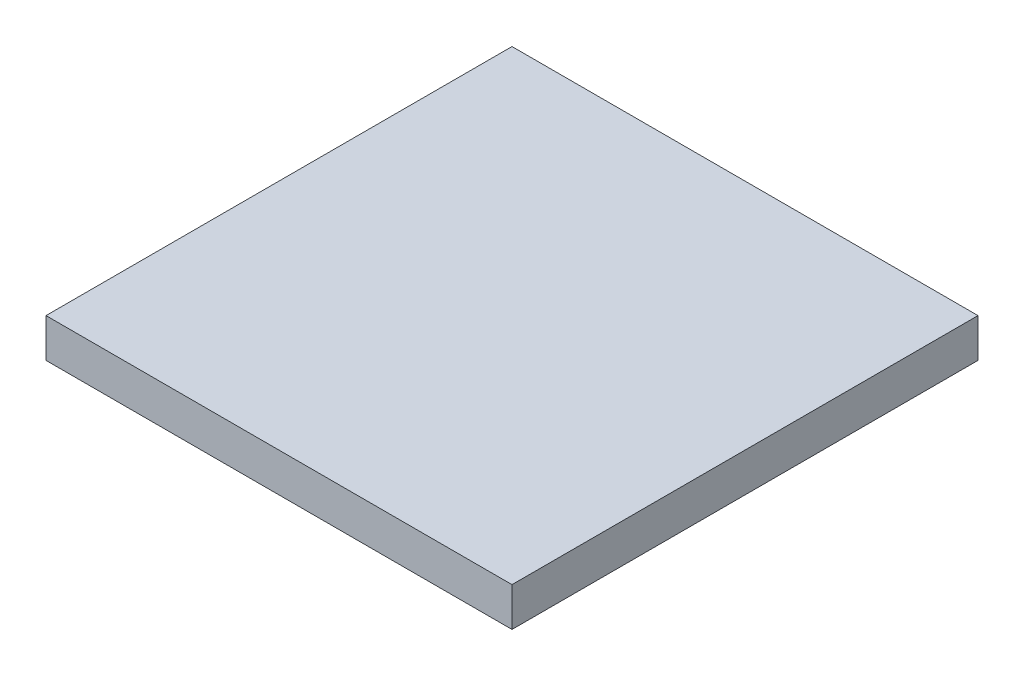
ISO-10303-21;
HEADER;
FILE_DESCRIPTION(('STEP AP214'),'2;1');
FILE_NAME('part.step','',(''),(''),'','','');
FILE_SCHEMA(('AUTOMOTIVE_DESIGN { 1 0 10303 214 1 1 1 1 }'));
ENDSEC;
DATA;
#1=APPLICATION_CONTEXT('core data for automotive mechanical design processes');
#2=APPLICATION_PROTOCOL_DEFINITION('international standard','automotive_design',2000,#1);
#3=PRODUCT_CONTEXT('',#1,'mechanical');
#4=PRODUCT('Part','Part','',(#3));
#5=PRODUCT_RELATED_PRODUCT_CATEGORY('part','',(#4));
#6=PRODUCT_DEFINITION_FORMATION('','',#4);
#7=PRODUCT_DEFINITION_CONTEXT('part definition',#1,'design');
#8=PRODUCT_DEFINITION('design','',#6,#7);
#9=PRODUCT_DEFINITION_SHAPE('','',#8);
#10=(LENGTH_UNIT() NAMED_UNIT(*) SI_UNIT(.MILLI.,.METRE.));
#11=(NAMED_UNIT(*) PLANE_ANGLE_UNIT() SI_UNIT($,.RADIAN.));
#12=(NAMED_UNIT(*) SI_UNIT($,.STERADIAN.) SOLID_ANGLE_UNIT());
#13=UNCERTAINTY_MEASURE_WITH_UNIT(LENGTH_MEASURE(1.E-05),#10,'distance_accuracy_value','');
#14=(GEOMETRIC_REPRESENTATION_CONTEXT(3) GLOBAL_UNCERTAINTY_ASSIGNED_CONTEXT((#13)) GLOBAL_UNIT_ASSIGNED_CONTEXT((#10,
#11,#12)) REPRESENTATION_CONTEXT('',''));
#15=CARTESIAN_POINT('',(0.,0.,0.));
#16=DIRECTION('',(0.,0.,1.));
#17=DIRECTION('',(1.,0.,0.));
#18=AXIS2_PLACEMENT_3D('',#15,#16,#17);
#19=CARTESIAN_POINT('',(0.,0.,0.));
#20=DIRECTION('',(0.,1.,0.));
#21=DIRECTION('',(0.,0.,1.));
#22=AXIS2_PLACEMENT_3D('',#19,#20,#21);
#23=PLANE('',#22);
#24=DIRECTION('',(0.,0.,-1.));
#25=VECTOR('',#24,1.);
#26=CARTESIAN_POINT('',(6.,0.,6.));
#27=LINE('',#26,#25);
#28=CARTESIAN_POINT('',(6.,0.,6.));
#29=VERTEX_POINT('',#28);
#30=CARTESIAN_POINT('',(6.,0.,-6.));
#31=VERTEX_POINT('',#30);
#32=EDGE_CURVE('E57',#29,#31,#27,.T.);
#33=ORIENTED_EDGE('',*,*,#32,.F.);
#34=DIRECTION('',(1.,0.,0.));
#35=VECTOR('',#34,1.);
#36=CARTESIAN_POINT('',(-6.,0.,6.));
#37=LINE('',#36,#35);
#38=CARTESIAN_POINT('',(-6.,0.,6.));
#39=VERTEX_POINT('',#38);
#40=EDGE_CURVE('E20',#39,#29,#37,.T.);
#41=ORIENTED_EDGE('',*,*,#40,.F.);
#42=DIRECTION('',(0.,0.,1.));
#43=VECTOR('',#42,1.);
#44=CARTESIAN_POINT('',(-6.,0.,-6.));
#45=LINE('',#44,#43);
#46=CARTESIAN_POINT('',(-6.,0.,-6.));
#47=VERTEX_POINT('',#46);
#48=EDGE_CURVE('E79',#47,#39,#45,.T.);
#49=ORIENTED_EDGE('',*,*,#48,.F.);
#50=DIRECTION('',(-1.,0.,0.));
#51=VECTOR('',#50,1.);
#52=CARTESIAN_POINT('',(6.,0.,-6.));
#53=LINE('',#52,#51);
#54=EDGE_CURVE('E55',#31,#47,#53,.T.);
#55=ORIENTED_EDGE('',*,*,#54,.F.);
#56=EDGE_LOOP('',(#33,#41,#49,#55));
#57=FACE_BOUND('',#56,.T.);
#58=ADVANCED_FACE('F17',(#57),#23,.F.);
#59=CARTESIAN_POINT('',(-6.,0.,6.));
#60=DIRECTION('',(0.,0.,1.));
#61=DIRECTION('',(1.,0.,0.));
#62=AXIS2_PLACEMENT_3D('',#59,#60,#61);
#63=PLANE('',#62);
#64=DIRECTION('',(1.,0.,0.));
#65=VECTOR('',#64,1.);
#66=CARTESIAN_POINT('',(0.,1.,6.));
#67=LINE('',#66,#65);
#68=CARTESIAN_POINT('',(-6.,1.,6.));
#69=VERTEX_POINT('',#68);
#70=CARTESIAN_POINT('',(6.,1.,6.));
#71=VERTEX_POINT('',#70);
#72=EDGE_CURVE('E83',#69,#71,#67,.T.);
#73=ORIENTED_EDGE('',*,*,#72,.F.);
#74=DIRECTION('',(0.,1.,0.));
#75=VECTOR('',#74,1.);
#76=CARTESIAN_POINT('',(-6.,0.,6.));
#77=LINE('',#76,#75);
#78=EDGE_CURVE('E68',#39,#69,#77,.T.);
#79=ORIENTED_EDGE('',*,*,#78,.F.);
#80=ORIENTED_EDGE('',*,*,#40,.T.);
#81=DIRECTION('',(0.,1.,0.));
#82=VECTOR('',#81,1.);
#83=CARTESIAN_POINT('',(6.,0.,6.));
#84=LINE('',#83,#82);
#85=EDGE_CURVE('E63',#71,#29,#84,.F.);
#86=ORIENTED_EDGE('',*,*,#85,.F.);
#87=EDGE_LOOP('',(#73,#79,#80,#86));
#88=FACE_BOUND('',#87,.T.);
#89=ADVANCED_FACE('F65',(#88),#63,.T.);
#90=CARTESIAN_POINT('',(6.,0.,6.));
#91=DIRECTION('',(1.,0.,0.));
#92=DIRECTION('',(0.,0.,-1.));
#93=AXIS2_PLACEMENT_3D('',#90,#91,#92);
#94=PLANE('',#93);
#95=DIRECTION('',(0.,0.,1.));
#96=VECTOR('',#95,1.);
#97=CARTESIAN_POINT('',(6.,1.,0.));
#98=LINE('',#97,#96);
#99=CARTESIAN_POINT('',(6.,1.,-6.));
#100=VERTEX_POINT('',#99);
#101=EDGE_CURVE('E72',#71,#100,#98,.F.);
#102=ORIENTED_EDGE('',*,*,#101,.F.);
#103=ORIENTED_EDGE('',*,*,#85,.T.);
#104=ORIENTED_EDGE('',*,*,#32,.T.);
#105=DIRECTION('',(0.,1.,0.));
#106=VECTOR('',#105,1.);
#107=CARTESIAN_POINT('',(6.,0.,-6.));
#108=LINE('',#107,#106);
#109=EDGE_CURVE('E75',#100,#31,#108,.F.);
#110=ORIENTED_EDGE('',*,*,#109,.F.);
#111=EDGE_LOOP('',(#102,#103,#104,#110));
#112=FACE_BOUND('',#111,.T.);
#113=ADVANCED_FACE('F70',(#112),#94,.T.);
#114=CARTESIAN_POINT('',(6.,0.,-6.));
#115=DIRECTION('',(0.,0.,-1.));
#116=DIRECTION('',(-1.,0.,0.));
#117=AXIS2_PLACEMENT_3D('',#114,#115,#116);
#118=PLANE('',#117);
#119=DIRECTION('',(1.,0.,0.));
#120=VECTOR('',#119,1.);
#121=CARTESIAN_POINT('',(0.,1.,-6.));
#122=LINE('',#121,#120);
#123=CARTESIAN_POINT('',(-6.,1.,-6.));
#124=VERTEX_POINT('',#123);
#125=EDGE_CURVE('E26',#100,#124,#122,.F.);
#126=ORIENTED_EDGE('',*,*,#125,.F.);
#127=ORIENTED_EDGE('',*,*,#109,.T.);
#128=ORIENTED_EDGE('',*,*,#54,.T.);
#129=DIRECTION('',(0.,1.,0.));
#130=VECTOR('',#129,1.);
#131=CARTESIAN_POINT('',(-6.,0.,-6.));
#132=LINE('',#131,#130);
#133=EDGE_CURVE('E35',#124,#47,#132,.F.);
#134=ORIENTED_EDGE('',*,*,#133,.F.);
#135=EDGE_LOOP('',(#126,#127,#128,#134));
#136=FACE_BOUND('',#135,.T.);
#137=ADVANCED_FACE('F89',(#136),#118,.T.);
#138=CARTESIAN_POINT('',(-6.,0.,-6.));
#139=DIRECTION('',(-1.,0.,0.));
#140=DIRECTION('',(0.,0.,1.));
#141=AXIS2_PLACEMENT_3D('',#138,#139,#140);
#142=PLANE('',#141);
#143=DIRECTION('',(0.,0.,1.));
#144=VECTOR('',#143,1.);
#145=CARTESIAN_POINT('',(-6.,1.,0.));
#146=LINE('',#145,#144);
#147=EDGE_CURVE('E11',#124,#69,#146,.T.);
#148=ORIENTED_EDGE('',*,*,#147,.F.);
#149=ORIENTED_EDGE('',*,*,#133,.T.);
#150=ORIENTED_EDGE('',*,*,#48,.T.);
#151=ORIENTED_EDGE('',*,*,#78,.T.);
#152=EDGE_LOOP('',(#148,#149,#150,#151));
#153=FACE_BOUND('',#152,.T.);
#154=ADVANCED_FACE('F91',(#153),#142,.T.);
#155=CARTESIAN_POINT('',(0.,1.,0.));
#156=DIRECTION('',(0.,1.,0.));
#157=DIRECTION('',(0.,0.,1.));
#158=AXIS2_PLACEMENT_3D('',#155,#156,#157);
#159=PLANE('',#158);
#160=ORIENTED_EDGE('',*,*,#125,.T.);
#161=ORIENTED_EDGE('',*,*,#147,.T.);
#162=ORIENTED_EDGE('',*,*,#72,.T.);
#163=ORIENTED_EDGE('',*,*,#101,.T.);
#164=EDGE_LOOP('',(#160,#161,#162,#163));
#165=FACE_BOUND('',#164,.T.);
#166=ADVANCED_FACE('F88',(#165),#159,.T.);
#167=CLOSED_SHELL('',(#58,#89,#113,#137,#154,#166));
#168=MANIFOLD_SOLID_BREP('B1',#167);
#169=ADVANCED_BREP_SHAPE_REPRESENTATION('',(#18,#168),#14);
#170=SHAPE_DEFINITION_REPRESENTATION(#9,#169);
ENDSEC;
END-ISO-10303-21;
